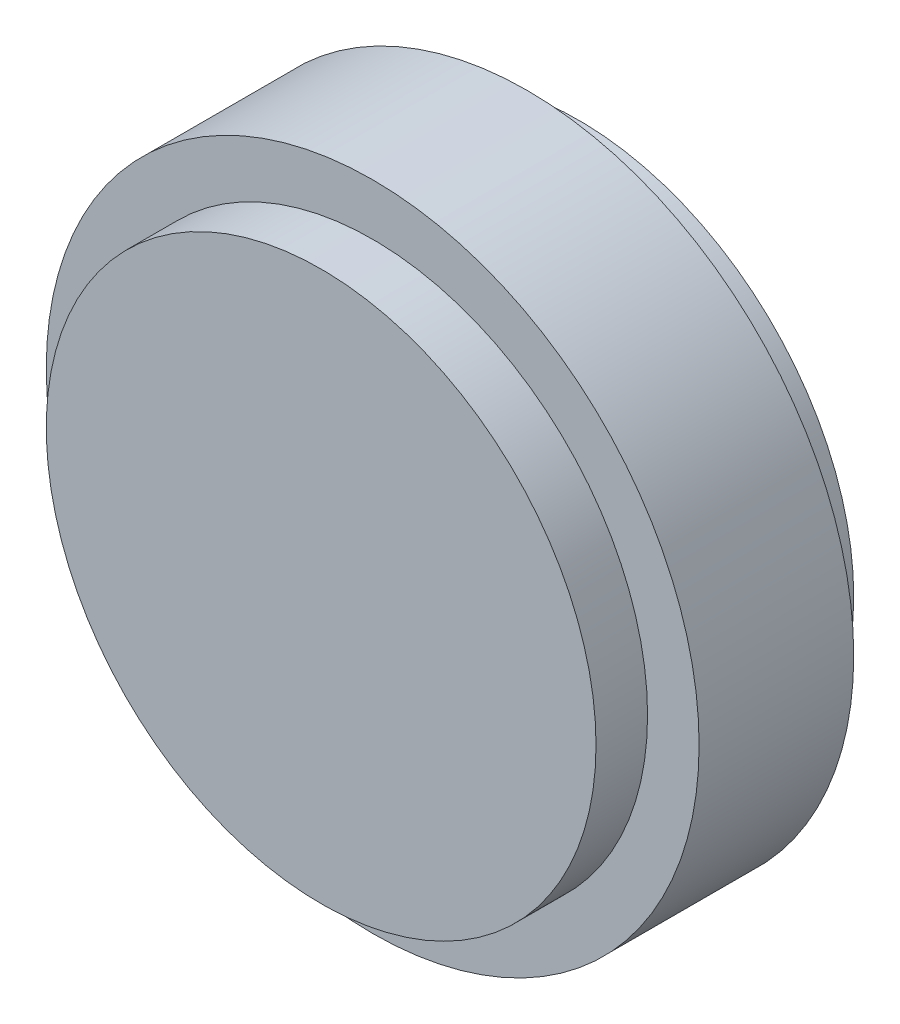
ISO-10303-21;
HEADER;
FILE_DESCRIPTION(('STEP AP214'),'2;1');
FILE_NAME('part.step','',(''),(''),'','','');
FILE_SCHEMA(('AUTOMOTIVE_DESIGN { 1 0 10303 214 1 1 1 1 }'));
ENDSEC;
DATA;
#1=APPLICATION_CONTEXT('core data for automotive mechanical design processes');
#2=APPLICATION_PROTOCOL_DEFINITION('international standard','automotive_design',2000,#1);
#3=PRODUCT_CONTEXT('',#1,'mechanical');
#4=PRODUCT('Part','Part','',(#3));
#5=PRODUCT_RELATED_PRODUCT_CATEGORY('part','',(#4));
#6=PRODUCT_DEFINITION_FORMATION('','',#4);
#7=PRODUCT_DEFINITION_CONTEXT('part definition',#1,'design');
#8=PRODUCT_DEFINITION('design','',#6,#7);
#9=PRODUCT_DEFINITION_SHAPE('','',#8);
#10=(LENGTH_UNIT() NAMED_UNIT(*) SI_UNIT(.MILLI.,.METRE.));
#11=(NAMED_UNIT(*) PLANE_ANGLE_UNIT() SI_UNIT($,.RADIAN.));
#12=(NAMED_UNIT(*) SI_UNIT($,.STERADIAN.) SOLID_ANGLE_UNIT());
#13=UNCERTAINTY_MEASURE_WITH_UNIT(LENGTH_MEASURE(1.E-05),#10,'distance_accuracy_value','');
#14=(GEOMETRIC_REPRESENTATION_CONTEXT(3) GLOBAL_UNCERTAINTY_ASSIGNED_CONTEXT((#13)) GLOBAL_UNIT_ASSIGNED_CONTEXT((#10,
#11,#12)) REPRESENTATION_CONTEXT('',''));
#15=CARTESIAN_POINT('',(0.,0.,0.));
#16=DIRECTION('',(0.,0.,1.));
#17=DIRECTION('',(1.,0.,0.));
#18=AXIS2_PLACEMENT_3D('',#15,#16,#17);
#19=CARTESIAN_POINT('',(0.,0.,0.));
#20=DIRECTION('',(0.,0.,-1.));
#21=DIRECTION('',(-1.,0.,0.));
#22=AXIS2_PLACEMENT_3D('',#19,#20,#21);
#23=PLANE('',#22);
#24=CARTESIAN_POINT('',(0.,0.,0.));
#25=DIRECTION('',(0.,0.,1.));
#26=DIRECTION('',(1.,0.,0.));
#27=AXIS2_PLACEMENT_3D('',#24,#25,#26);
#28=CIRCLE('',#27,16.);
#29=CARTESIAN_POINT('',(16.,0.,0.));
#30=VERTEX_POINT('',#29);
#31=EDGE_CURVE('E10',#30,#30,#28,.T.);
#32=ORIENTED_EDGE('',*,*,#31,.T.);
#33=EDGE_LOOP('',(#32));
#34=FACE_BOUND('',#33,.T.);
#35=ADVANCED_FACE('F40',(#34),#23,.F.);
#36=CARTESIAN_POINT('',(0.,0.,0.));
#37=DIRECTION('',(0.,0.,1.));
#38=DIRECTION('',(1.,0.,0.));
#39=AXIS2_PLACEMENT_3D('',#36,#37,#38);
#40=CYLINDRICAL_SURFACE('',#39,16.);
#41=ORIENTED_EDGE('',*,*,#31,.F.);
#42=EDGE_LOOP('',(#41));
#43=FACE_BOUND('',#42,.T.);
#44=CARTESIAN_POINT('',(0.,0.,-3.));
#45=DIRECTION('',(0.,0.,1.));
#46=DIRECTION('',(1.,0.,0.));
#47=AXIS2_PLACEMENT_3D('',#44,#45,#46);
#48=CIRCLE('',#47,16.);
#49=CARTESIAN_POINT('',(16.,0.,-3.));
#50=VERTEX_POINT('',#49);
#51=EDGE_CURVE('E46',#50,#50,#48,.T.);
#52=ORIENTED_EDGE('',*,*,#51,.T.);
#53=EDGE_LOOP('',(#52));
#54=FACE_BOUND('',#53,.T.);
#55=ADVANCED_FACE('F78',(#43,#54),#40,.T.);
#56=CARTESIAN_POINT('',(0.,16.,-3.));
#57=DIRECTION('',(0.,0.,-1.));
#58=DIRECTION('',(-1.,0.,0.));
#59=AXIS2_PLACEMENT_3D('',#56,#57,#58);
#60=PLANE('',#59);
#61=ORIENTED_EDGE('',*,*,#51,.F.);
#62=EDGE_LOOP('',(#61));
#63=FACE_BOUND('',#62,.T.);
#64=CARTESIAN_POINT('',(0.,0.,-3.));
#65=DIRECTION('',(0.,0.,1.));
#66=DIRECTION('',(1.,0.,0.));
#67=AXIS2_PLACEMENT_3D('',#64,#65,#66);
#68=CIRCLE('',#67,19.);
#69=CARTESIAN_POINT('',(19.,0.,-3.));
#70=VERTEX_POINT('',#69);
#71=EDGE_CURVE('E50',#70,#70,#68,.T.);
#72=ORIENTED_EDGE('',*,*,#71,.T.);
#73=EDGE_LOOP('',(#72));
#74=FACE_BOUND('',#73,.T.);
#75=ADVANCED_FACE('F82',(#63,#74),#60,.F.);
#76=CARTESIAN_POINT('',(0.,0.,0.));
#77=DIRECTION('',(0.,0.,1.));
#78=DIRECTION('',(1.,0.,0.));
#79=AXIS2_PLACEMENT_3D('',#76,#77,#78);
#80=CYLINDRICAL_SURFACE('',#79,19.);
#81=ORIENTED_EDGE('',*,*,#71,.F.);
#82=EDGE_LOOP('',(#81));
#83=FACE_BOUND('',#82,.T.);
#84=CARTESIAN_POINT('',(0.,0.,-12.));
#85=DIRECTION('',(0.,0.,1.));
#86=DIRECTION('',(1.,0.,0.));
#87=AXIS2_PLACEMENT_3D('',#84,#85,#86);
#88=CIRCLE('',#87,19.);
#89=CARTESIAN_POINT('',(19.,0.,-12.));
#90=VERTEX_POINT('',#89);
#91=EDGE_CURVE('E54',#90,#90,#88,.T.);
#92=ORIENTED_EDGE('',*,*,#91,.T.);
#93=EDGE_LOOP('',(#92));
#94=FACE_BOUND('',#93,.T.);
#95=ADVANCED_FACE('F87',(#83,#94),#80,.T.);
#96=CARTESIAN_POINT('',(0.,16.,-12.));
#97=DIRECTION('',(0.,0.,1.));
#98=DIRECTION('',(1.,0.,0.));
#99=AXIS2_PLACEMENT_3D('',#96,#97,#98);
#100=PLANE('',#99);
#101=ORIENTED_EDGE('',*,*,#91,.F.);
#102=EDGE_LOOP('',(#101));
#103=FACE_BOUND('',#102,.T.);
#104=CARTESIAN_POINT('',(0.,0.,-12.));
#105=DIRECTION('',(0.,0.,1.));
#106=DIRECTION('',(1.,0.,0.));
#107=AXIS2_PLACEMENT_3D('',#104,#105,#106);
#108=CIRCLE('',#107,16.);
#109=CARTESIAN_POINT('',(16.,0.,-12.));
#110=VERTEX_POINT('',#109);
#111=EDGE_CURVE('E59',#110,#110,#108,.T.);
#112=ORIENTED_EDGE('',*,*,#111,.T.);
#113=EDGE_LOOP('',(#112));
#114=FACE_BOUND('',#113,.T.);
#115=ADVANCED_FACE('F74',(#103,#114),#100,.F.);
#116=CARTESIAN_POINT('',(0.,0.,0.));
#117=DIRECTION('',(0.,0.,1.));
#118=DIRECTION('',(1.,0.,0.));
#119=AXIS2_PLACEMENT_3D('',#116,#117,#118);
#120=CYLINDRICAL_SURFACE('',#119,16.);
#121=ORIENTED_EDGE('',*,*,#111,.F.);
#122=EDGE_LOOP('',(#121));
#123=FACE_BOUND('',#122,.T.);
#124=CARTESIAN_POINT('',(0.,0.,-15.));
#125=DIRECTION('',(0.,0.,1.));
#126=DIRECTION('',(1.,0.,0.));
#127=AXIS2_PLACEMENT_3D('',#124,#125,#126);
#128=CIRCLE('',#127,16.);
#129=CARTESIAN_POINT('',(16.,0.,-15.));
#130=VERTEX_POINT('',#129);
#131=EDGE_CURVE('E62',#130,#130,#128,.T.);
#132=ORIENTED_EDGE('',*,*,#131,.T.);
#133=EDGE_LOOP('',(#132));
#134=FACE_BOUND('',#133,.T.);
#135=ADVANCED_FACE('F66',(#123,#134),#120,.T.);
#136=CARTESIAN_POINT('',(0.,0.,-15.));
#137=DIRECTION('',(0.,0.,1.));
#138=DIRECTION('',(1.,0.,0.));
#139=AXIS2_PLACEMENT_3D('',#136,#137,#138);
#140=PLANE('',#139);
#141=ORIENTED_EDGE('',*,*,#131,.F.);
#142=EDGE_LOOP('',(#141));
#143=FACE_BOUND('',#142,.T.);
#144=ADVANCED_FACE('F68',(#143),#140,.F.);
#145=CLOSED_SHELL('',(#35,#55,#75,#95,#115,#135,#144));
#146=MANIFOLD_SOLID_BREP('B2',#145);
#147=ADVANCED_BREP_SHAPE_REPRESENTATION('',(#18,#146),#14);
#148=SHAPE_DEFINITION_REPRESENTATION(#9,#147);
ENDSEC;
END-ISO-10303-21;
